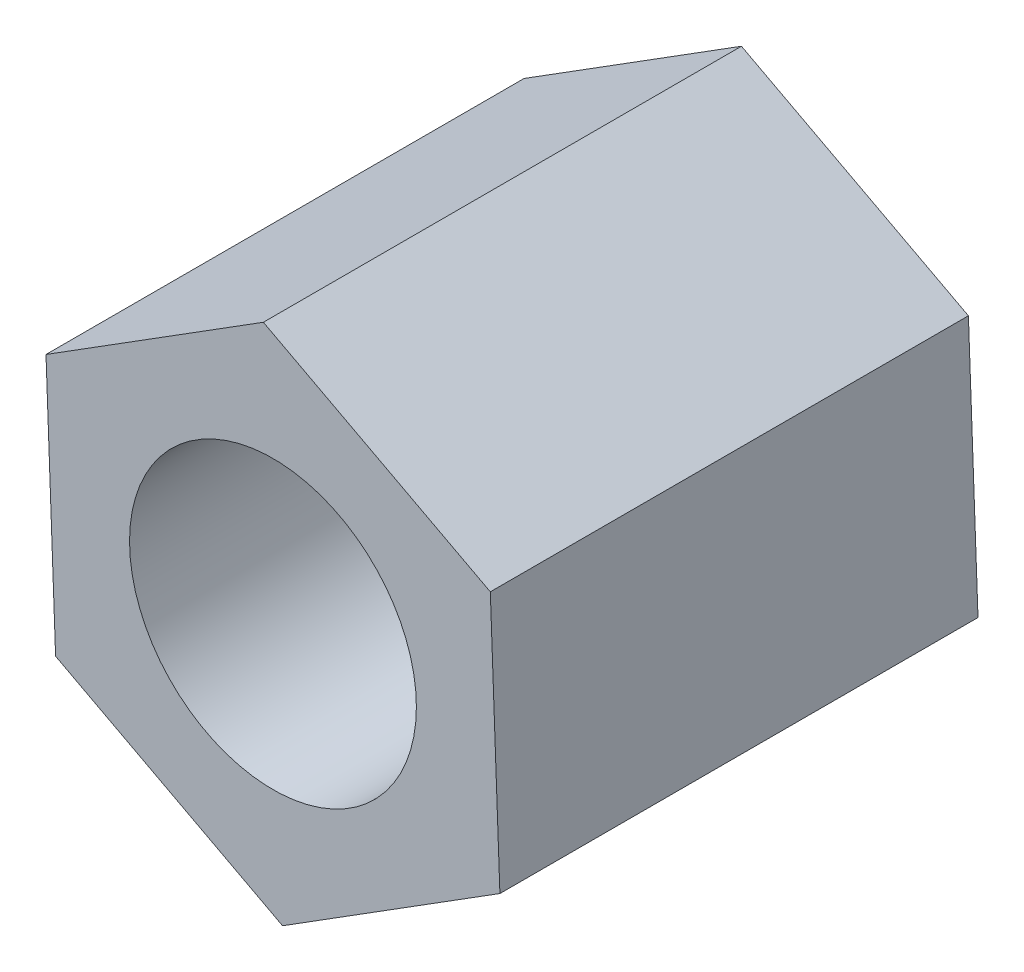
ISO-10303-21;
HEADER;
FILE_DESCRIPTION(('STEP AP214'),'2;1');
FILE_NAME('part.step','',(''),(''),'','','');
FILE_SCHEMA(('AUTOMOTIVE_DESIGN { 1 0 10303 214 1 1 1 1 }'));
ENDSEC;
DATA;
#1=APPLICATION_CONTEXT('core data for automotive mechanical design processes');
#2=APPLICATION_PROTOCOL_DEFINITION('international standard','automotive_design',2000,#1);
#3=PRODUCT_CONTEXT('',#1,'mechanical');
#4=PRODUCT('Part','Part','',(#3));
#5=PRODUCT_RELATED_PRODUCT_CATEGORY('part','',(#4));
#6=PRODUCT_DEFINITION_FORMATION('','',#4);
#7=PRODUCT_DEFINITION_CONTEXT('part definition',#1,'design');
#8=PRODUCT_DEFINITION('design','',#6,#7);
#9=PRODUCT_DEFINITION_SHAPE('','',#8);
#10=(LENGTH_UNIT() NAMED_UNIT(*) SI_UNIT(.MILLI.,.METRE.));
#11=(NAMED_UNIT(*) PLANE_ANGLE_UNIT() SI_UNIT($,.RADIAN.));
#12=(NAMED_UNIT(*) SI_UNIT($,.STERADIAN.) SOLID_ANGLE_UNIT());
#13=UNCERTAINTY_MEASURE_WITH_UNIT(LENGTH_MEASURE(1.E-05),#10,'distance_accuracy_value','');
#14=(GEOMETRIC_REPRESENTATION_CONTEXT(3) GLOBAL_UNCERTAINTY_ASSIGNED_CONTEXT((#13)) GLOBAL_UNIT_ASSIGNED_CONTEXT((#10,
#11,#12)) REPRESENTATION_CONTEXT('',''));
#15=CARTESIAN_POINT('',(0.,0.,0.));
#16=DIRECTION('',(0.,0.,1.));
#17=DIRECTION('',(1.,0.,0.));
#18=AXIS2_PLACEMENT_3D('',#15,#16,#17);
#19=CARTESIAN_POINT('',(0.,0.,5.));
#20=DIRECTION('',(0.,0.,1.));
#21=DIRECTION('',(1.,0.,0.));
#22=AXIS2_PLACEMENT_3D('',#19,#20,#21);
#23=PLANE('',#22);
#24=DIRECTION('',(-0.0373746720524852,0.999301322869618,0.));
#25=VECTOR('',#24,1.);
#26=CARTESIAN_POINT('',(2.37354506962798,-1.25450540152072,5.));
#27=LINE('',#26,#25);
#28=CARTESIAN_POINT('',(2.37354506962798,-1.25450540152072,5.));
#29=VERTEX_POINT('',#28);
#30=CARTESIAN_POINT('',(2.27320608171573,1.42829762656477,5.));
#31=VERTEX_POINT('',#30);
#32=EDGE_CURVE('E131',#29,#31,#27,.T.);
#33=ORIENTED_EDGE('',*,*,#32,.T.);
#34=DIRECTION('',(-0.884107667666727,0.467283245979245,0.));
#35=VECTOR('',#34,1.);
#36=CARTESIAN_POINT('',(2.27320608171573,1.42829762656477,5.));
#37=LINE('',#36,#35);
#38=CARTESIAN_POINT('',(-0.100338987912251,2.68280302808549,5.));
#39=VERTEX_POINT('',#38);
#40=EDGE_CURVE('E89',#31,#39,#37,.T.);
#41=ORIENTED_EDGE('',*,*,#40,.T.);
#42=DIRECTION('',(-0.846732995614242,-0.532018076890375,0.));
#43=VECTOR('',#42,1.);
#44=CARTESIAN_POINT('',(-0.100338987912251,2.68280302808549,5.));
#45=LINE('',#44,#43);
#46=CARTESIAN_POINT('',(-2.37354506962798,1.25450540152072,5.));
#47=VERTEX_POINT('',#46);
#48=EDGE_CURVE('E102',#39,#47,#45,.T.);
#49=ORIENTED_EDGE('',*,*,#48,.T.);
#50=DIRECTION('',(0.0373746720524864,-0.999301322869618,0.));
#51=VECTOR('',#50,1.);
#52=CARTESIAN_POINT('',(-2.37354506962798,1.25450540152072,5.));
#53=LINE('',#52,#51);
#54=CARTESIAN_POINT('',(-2.27320608171573,-1.42829762656478,5.));
#55=VERTEX_POINT('',#54);
#56=EDGE_CURVE('E96',#47,#55,#53,.T.);
#57=ORIENTED_EDGE('',*,*,#56,.T.);
#58=DIRECTION('',(0.884107667666728,-0.467283245979244,0.));
#59=VECTOR('',#58,1.);
#60=CARTESIAN_POINT('',(-2.27320608171573,-1.42829762656478,5.));
#61=LINE('',#60,#59);
#62=CARTESIAN_POINT('',(0.100338987912251,-2.68280302808549,5.));
#63=VERTEX_POINT('',#62);
#64=EDGE_CURVE('E100',#55,#63,#61,.T.);
#65=ORIENTED_EDGE('',*,*,#64,.T.);
#66=DIRECTION('',(0.846732995614242,0.532018076890374,0.));
#67=VECTOR('',#66,1.);
#68=CARTESIAN_POINT('',(0.100338987912251,-2.68280302808549,5.));
#69=LINE('',#68,#67);
#70=EDGE_CURVE('E52',#63,#29,#69,.T.);
#71=ORIENTED_EDGE('',*,*,#70,.T.);
#72=EDGE_LOOP('',(#33,#41,#49,#57,#65,#71));
#73=FACE_BOUND('',#72,.T.);
#74=CARTESIAN_POINT('',(0.,0.,5.));
#75=DIRECTION('',(0.,0.,1.));
#76=DIRECTION('',(1.,0.,0.));
#77=AXIS2_PLACEMENT_3D('',#74,#75,#76);
#78=CIRCLE('',#77,1.5);
#79=CARTESIAN_POINT('',(1.5,0.,5.));
#80=VERTEX_POINT('',#79);
#81=EDGE_CURVE('E124',#80,#80,#78,.T.);
#82=ORIENTED_EDGE('',*,*,#81,.F.);
#83=EDGE_LOOP('',(#82));
#84=FACE_BOUND('',#83,.T.);
#85=ADVANCED_FACE('F35',(#73,#84),#23,.T.);
#86=CARTESIAN_POINT('',(0.,0.,0.));
#87=DIRECTION('',(0.,0.,1.));
#88=DIRECTION('',(1.,0.,0.));
#89=AXIS2_PLACEMENT_3D('',#86,#87,#88);
#90=PLANE('',#89);
#91=DIRECTION('',(-0.0373746720524852,0.999301322869618,0.));
#92=VECTOR('',#91,1.);
#93=CARTESIAN_POINT('',(2.37354506962798,-1.25450540152072,0.));
#94=LINE('',#93,#92);
#95=CARTESIAN_POINT('',(2.37354506962798,-1.25450540152072,0.));
#96=VERTEX_POINT('',#95);
#97=CARTESIAN_POINT('',(2.27320608171573,1.42829762656477,0.));
#98=VERTEX_POINT('',#97);
#99=EDGE_CURVE('E120',#96,#98,#94,.T.);
#100=ORIENTED_EDGE('',*,*,#99,.F.);
#101=DIRECTION('',(0.846732995614242,0.532018076890374,0.));
#102=VECTOR('',#101,1.);
#103=CARTESIAN_POINT('',(0.100338987912251,-2.68280302808549,0.));
#104=LINE('',#103,#102);
#105=CARTESIAN_POINT('',(0.100338987912251,-2.68280302808549,0.));
#106=VERTEX_POINT('',#105);
#107=EDGE_CURVE('E81',#106,#96,#104,.T.);
#108=ORIENTED_EDGE('',*,*,#107,.F.);
#109=DIRECTION('',(0.884107667666728,-0.467283245979244,0.));
#110=VECTOR('',#109,1.);
#111=CARTESIAN_POINT('',(-2.27320608171573,-1.42829762656478,0.));
#112=LINE('',#111,#110);
#113=CARTESIAN_POINT('',(-2.27320608171573,-1.42829762656478,0.));
#114=VERTEX_POINT('',#113);
#115=EDGE_CURVE('E75',#114,#106,#112,.T.);
#116=ORIENTED_EDGE('',*,*,#115,.F.);
#117=DIRECTION('',(0.0373746720524864,-0.999301322869618,0.));
#118=VECTOR('',#117,1.);
#119=CARTESIAN_POINT('',(-2.37354506962798,1.25450540152072,0.));
#120=LINE('',#119,#118);
#121=CARTESIAN_POINT('',(-2.37354506962798,1.25450540152072,0.));
#122=VERTEX_POINT('',#121);
#123=EDGE_CURVE('E110',#122,#114,#120,.T.);
#124=ORIENTED_EDGE('',*,*,#123,.F.);
#125=DIRECTION('',(-0.846732995614242,-0.532018076890375,0.));
#126=VECTOR('',#125,1.);
#127=CARTESIAN_POINT('',(-0.100338987912251,2.68280302808549,0.));
#128=LINE('',#127,#126);
#129=CARTESIAN_POINT('',(-0.100338987912251,2.68280302808549,0.));
#130=VERTEX_POINT('',#129);
#131=EDGE_CURVE('E126',#130,#122,#128,.T.);
#132=ORIENTED_EDGE('',*,*,#131,.F.);
#133=DIRECTION('',(-0.884107667666727,0.467283245979245,0.));
#134=VECTOR('',#133,1.);
#135=CARTESIAN_POINT('',(2.27320608171573,1.42829762656477,0.));
#136=LINE('',#135,#134);
#137=EDGE_CURVE('E123',#98,#130,#136,.T.);
#138=ORIENTED_EDGE('',*,*,#137,.F.);
#139=EDGE_LOOP('',(#100,#108,#116,#124,#132,#138));
#140=FACE_BOUND('',#139,.T.);
#141=CARTESIAN_POINT('',(0.,0.,0.));
#142=DIRECTION('',(0.,0.,1.));
#143=DIRECTION('',(1.,0.,0.));
#144=AXIS2_PLACEMENT_3D('',#141,#142,#143);
#145=CIRCLE('',#144,1.5);
#146=CARTESIAN_POINT('',(1.5,0.,0.));
#147=VERTEX_POINT('',#146);
#148=EDGE_CURVE('E224',#147,#147,#145,.T.);
#149=ORIENTED_EDGE('',*,*,#148,.T.);
#150=EDGE_LOOP('',(#149));
#151=FACE_BOUND('',#150,.T.);
#152=ADVANCED_FACE('F140',(#140,#151),#90,.F.);
#153=CARTESIAN_POINT('',(2.37354506962798,-1.25450540152072,5.));
#154=DIRECTION('',(-0.999301322869618,-0.0373746720524852,0.));
#155=DIRECTION('',(0.0373746720524852,-0.999301322869618,0.));
#156=AXIS2_PLACEMENT_3D('',#153,#154,#155);
#157=PLANE('',#156);
#158=ORIENTED_EDGE('',*,*,#99,.T.);
#159=DIRECTION('',(0.,0.,-1.));
#160=VECTOR('',#159,1.);
#161=CARTESIAN_POINT('',(2.27320608171573,1.42829762656477,5.));
#162=LINE('',#161,#160);
#163=EDGE_CURVE('E11',#31,#98,#162,.T.);
#164=ORIENTED_EDGE('',*,*,#163,.F.);
#165=ORIENTED_EDGE('',*,*,#32,.F.);
#166=DIRECTION('',(0.,0.,-1.));
#167=VECTOR('',#166,1.);
#168=CARTESIAN_POINT('',(2.37354506962798,-1.25450540152072,5.));
#169=LINE('',#168,#167);
#170=EDGE_CURVE('E116',#29,#96,#169,.T.);
#171=ORIENTED_EDGE('',*,*,#170,.T.);
#172=EDGE_LOOP('',(#158,#164,#165,#171));
#173=FACE_BOUND('',#172,.T.);
#174=ADVANCED_FACE('F37',(#173),#157,.F.);
#175=CARTESIAN_POINT('',(2.27320608171573,1.42829762656477,5.));
#176=DIRECTION('',(-0.467283245979245,-0.884107667666727,0.));
#177=DIRECTION('',(0.884107667666727,-0.467283245979245,0.));
#178=AXIS2_PLACEMENT_3D('',#175,#176,#177);
#179=PLANE('',#178);
#180=ORIENTED_EDGE('',*,*,#137,.T.);
#181=DIRECTION('',(0.,0.,-1.));
#182=VECTOR('',#181,1.);
#183=CARTESIAN_POINT('',(-0.100338987912251,2.68280302808549,5.));
#184=LINE('',#183,#182);
#185=EDGE_CURVE('E44',#39,#130,#184,.T.);
#186=ORIENTED_EDGE('',*,*,#185,.F.);
#187=ORIENTED_EDGE('',*,*,#40,.F.);
#188=ORIENTED_EDGE('',*,*,#163,.T.);
#189=EDGE_LOOP('',(#180,#186,#187,#188));
#190=FACE_BOUND('',#189,.T.);
#191=ADVANCED_FACE('F165',(#190),#179,.F.);
#192=CARTESIAN_POINT('',(-0.100338987912251,2.68280302808549,5.));
#193=DIRECTION('',(0.532018076890375,-0.846732995614242,0.));
#194=DIRECTION('',(0.846732995614242,0.532018076890375,0.));
#195=AXIS2_PLACEMENT_3D('',#192,#193,#194);
#196=PLANE('',#195);
#197=ORIENTED_EDGE('',*,*,#131,.T.);
#198=DIRECTION('',(0.,0.,-1.));
#199=VECTOR('',#198,1.);
#200=CARTESIAN_POINT('',(-2.37354506962798,1.25450540152072,5.));
#201=LINE('',#200,#199);
#202=EDGE_CURVE('E111',#47,#122,#201,.T.);
#203=ORIENTED_EDGE('',*,*,#202,.F.);
#204=ORIENTED_EDGE('',*,*,#48,.F.);
#205=ORIENTED_EDGE('',*,*,#185,.T.);
#206=EDGE_LOOP('',(#197,#203,#204,#205));
#207=FACE_BOUND('',#206,.T.);
#208=ADVANCED_FACE('F137',(#207),#196,.F.);
#209=CARTESIAN_POINT('',(-2.37354506962798,1.25450540152072,5.));
#210=DIRECTION('',(0.999301322869618,0.0373746720524864,0.));
#211=DIRECTION('',(-0.0373746720524864,0.999301322869618,0.));
#212=AXIS2_PLACEMENT_3D('',#209,#210,#211);
#213=PLANE('',#212);
#214=ORIENTED_EDGE('',*,*,#123,.T.);
#215=DIRECTION('',(0.,0.,-1.));
#216=VECTOR('',#215,1.);
#217=CARTESIAN_POINT('',(-2.27320608171573,-1.42829762656478,5.));
#218=LINE('',#217,#216);
#219=EDGE_CURVE('E107',#55,#114,#218,.T.);
#220=ORIENTED_EDGE('',*,*,#219,.F.);
#221=ORIENTED_EDGE('',*,*,#56,.F.);
#222=ORIENTED_EDGE('',*,*,#202,.T.);
#223=EDGE_LOOP('',(#214,#220,#221,#222));
#224=FACE_BOUND('',#223,.T.);
#225=ADVANCED_FACE('F108',(#224),#213,.F.);
#226=CARTESIAN_POINT('',(-2.27320608171573,-1.42829762656478,5.));
#227=DIRECTION('',(0.467283245979244,0.884107667666728,0.));
#228=DIRECTION('',(-0.884107667666728,0.467283245979244,0.));
#229=AXIS2_PLACEMENT_3D('',#226,#227,#228);
#230=PLANE('',#229);
#231=ORIENTED_EDGE('',*,*,#115,.T.);
#232=DIRECTION('',(0.,0.,-1.));
#233=VECTOR('',#232,1.);
#234=CARTESIAN_POINT('',(0.100338987912251,-2.68280302808549,5.));
#235=LINE('',#234,#233);
#236=EDGE_CURVE('E112',#63,#106,#235,.T.);
#237=ORIENTED_EDGE('',*,*,#236,.F.);
#238=ORIENTED_EDGE('',*,*,#64,.F.);
#239=ORIENTED_EDGE('',*,*,#219,.T.);
#240=EDGE_LOOP('',(#231,#237,#238,#239));
#241=FACE_BOUND('',#240,.T.);
#242=ADVANCED_FACE('F114',(#241),#230,.F.);
#243=CARTESIAN_POINT('',(0.100338987912251,-2.68280302808549,5.));
#244=DIRECTION('',(-0.532018076890374,0.846732995614242,0.));
#245=DIRECTION('',(-0.846732995614242,-0.532018076890375,0.));
#246=AXIS2_PLACEMENT_3D('',#243,#244,#245);
#247=PLANE('',#246);
#248=ORIENTED_EDGE('',*,*,#107,.T.);
#249=ORIENTED_EDGE('',*,*,#170,.F.);
#250=ORIENTED_EDGE('',*,*,#70,.F.);
#251=ORIENTED_EDGE('',*,*,#236,.T.);
#252=EDGE_LOOP('',(#248,#249,#250,#251));
#253=FACE_BOUND('',#252,.T.);
#254=ADVANCED_FACE('F145',(#253),#247,.F.);
#255=CARTESIAN_POINT('',(0.,0.,5.));
#256=DIRECTION('',(0.,0.,-1.));
#257=DIRECTION('',(-1.,0.,0.));
#258=AXIS2_PLACEMENT_3D('',#255,#256,#257);
#259=CYLINDRICAL_SURFACE('',#258,1.5);
#260=ORIENTED_EDGE('',*,*,#81,.T.);
#261=EDGE_LOOP('',(#260));
#262=FACE_BOUND('',#261,.T.);
#263=ORIENTED_EDGE('',*,*,#148,.F.);
#264=EDGE_LOOP('',(#263));
#265=FACE_BOUND('',#264,.T.);
#266=ADVANCED_FACE('F147',(#262,#265),#259,.F.);
#267=CLOSED_SHELL('',(#85,#152,#174,#191,#208,#225,#242,#254,#266));
#268=MANIFOLD_SOLID_BREP('B2',#267);
#269=ADVANCED_BREP_SHAPE_REPRESENTATION('',(#18,#268),#14);
#270=SHAPE_DEFINITION_REPRESENTATION(#9,#269);
ENDSEC;
END-ISO-10303-21;
